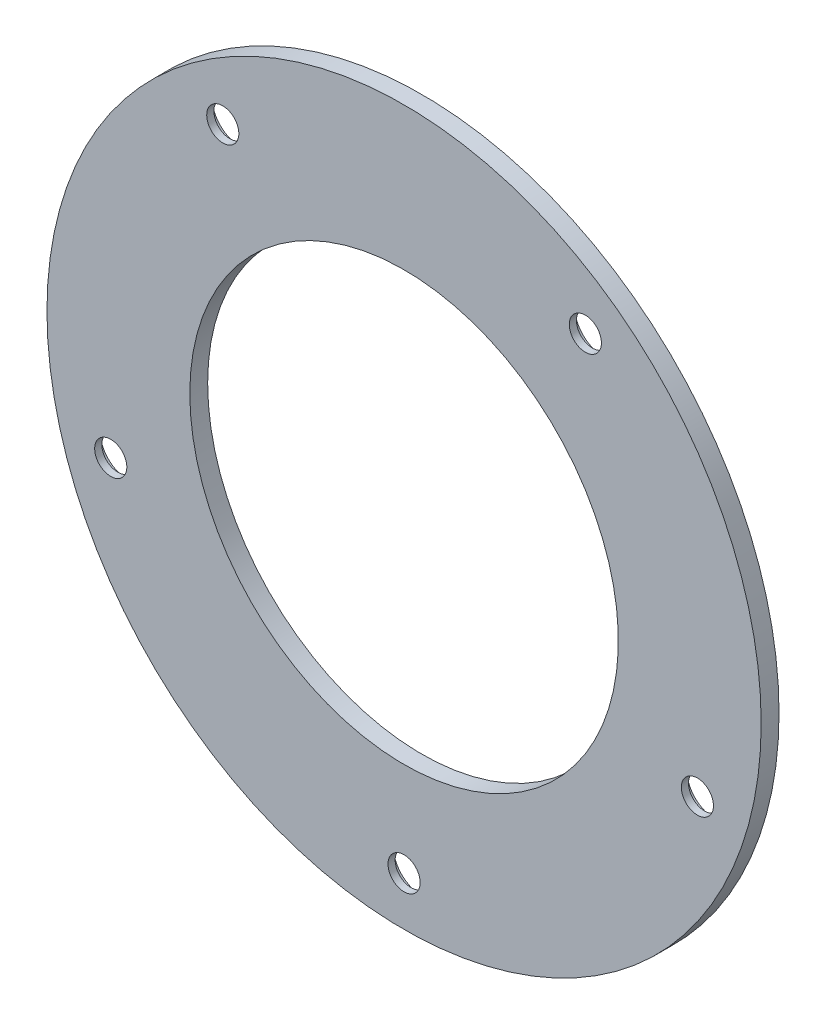
ISO-10303-21;
HEADER;
FILE_DESCRIPTION(('STEP AP214'),'2;1');
FILE_NAME('part.step','',(''),(''),'','','');
FILE_SCHEMA(('AUTOMOTIVE_DESIGN { 1 0 10303 214 1 1 1 1 }'));
ENDSEC;
DATA;
#1=APPLICATION_CONTEXT('core data for automotive mechanical design processes');
#2=APPLICATION_PROTOCOL_DEFINITION('international standard','automotive_design',2000,#1);
#3=PRODUCT_CONTEXT('',#1,'mechanical');
#4=PRODUCT('Part','Part','',(#3));
#5=PRODUCT_RELATED_PRODUCT_CATEGORY('part','',(#4));
#6=PRODUCT_DEFINITION_FORMATION('','',#4);
#7=PRODUCT_DEFINITION_CONTEXT('part definition',#1,'design');
#8=PRODUCT_DEFINITION('design','',#6,#7);
#9=PRODUCT_DEFINITION_SHAPE('','',#8);
#10=(LENGTH_UNIT() NAMED_UNIT(*) SI_UNIT(.MILLI.,.METRE.));
#11=(NAMED_UNIT(*) PLANE_ANGLE_UNIT() SI_UNIT($,.RADIAN.));
#12=(NAMED_UNIT(*) SI_UNIT($,.STERADIAN.) SOLID_ANGLE_UNIT());
#13=UNCERTAINTY_MEASURE_WITH_UNIT(LENGTH_MEASURE(1.E-05),#10,'distance_accuracy_value','');
#14=(GEOMETRIC_REPRESENTATION_CONTEXT(3) GLOBAL_UNCERTAINTY_ASSIGNED_CONTEXT((#13)) GLOBAL_UNIT_ASSIGNED_CONTEXT((#10,
#11,#12)) REPRESENTATION_CONTEXT('',''));
#15=CARTESIAN_POINT('',(0.,0.,0.));
#16=DIRECTION('',(0.,0.,1.));
#17=DIRECTION('',(1.,0.,0.));
#18=AXIS2_PLACEMENT_3D('',#15,#16,#17);
#19=CARTESIAN_POINT('',(0.,0.,22.5));
#20=DIRECTION('',(0.,0.,-1.));
#21=DIRECTION('',(0.,-1.,0.));
#22=AXIS2_PLACEMENT_3D('',#19,#20,#21);
#23=PLANE('',#22);
#24=CARTESIAN_POINT('',(0.,-43.1823986086603,22.5));
#25=DIRECTION('',(0.,0.,-1.));
#26=DIRECTION('',(-1.,0.,0.));
#27=AXIS2_PLACEMENT_3D('',#24,#25,#26);
#28=CIRCLE('',#27,4.);
#29=CARTESIAN_POINT('',(-4.,-43.1823986086603,22.5));
#30=VERTEX_POINT('',#29);
#31=EDGE_CURVE('E11',#30,#30,#28,.T.);
#32=ORIENTED_EDGE('',*,*,#31,.T.);
#33=EDGE_LOOP('',(#32));
#34=FACE_BOUND('',#33,.T.);
#35=CARTESIAN_POINT('',(0.,-43.1823986086603,22.5));
#36=DIRECTION('',(0.,0.,-1.));
#37=DIRECTION('',(-1.,0.,0.));
#38=AXIS2_PLACEMENT_3D('',#35,#36,#37);
#39=CIRCLE('',#38,2.25);
#40=CARTESIAN_POINT('',(-2.25,-43.1823986086603,22.5));
#41=VERTEX_POINT('',#40);
#42=EDGE_CURVE('E148',#41,#41,#39,.T.);
#43=ORIENTED_EDGE('',*,*,#42,.F.);
#44=EDGE_LOOP('',(#43));
#45=FACE_BOUND('',#44,.T.);
#46=ADVANCED_FACE('F17',(#34,#45),#23,.T.);
#47=CARTESIAN_POINT('',(0.,-43.1823986086603,22.5));
#48=DIRECTION('',(0.,0.,-1.));
#49=DIRECTION('',(-1.,0.,0.));
#50=AXIS2_PLACEMENT_3D('',#47,#48,#49);
#51=CYLINDRICAL_SURFACE('',#50,4.);
#52=CARTESIAN_POINT('',(0.,-43.1823986086603,21.));
#53=DIRECTION('',(0.,0.,-1.));
#54=DIRECTION('',(-1.,0.,0.));
#55=AXIS2_PLACEMENT_3D('',#52,#53,#54);
#56=CIRCLE('',#55,4.);
#57=CARTESIAN_POINT('',(-4.,-43.1823986086603,21.));
#58=VERTEX_POINT('',#57);
#59=EDGE_CURVE('E168',#58,#58,#56,.T.);
#60=ORIENTED_EDGE('',*,*,#59,.T.);
#61=EDGE_LOOP('',(#60));
#62=FACE_BOUND('',#61,.T.);
#63=ORIENTED_EDGE('',*,*,#31,.F.);
#64=EDGE_LOOP('',(#63));
#65=FACE_BOUND('',#64,.T.);
#66=ADVANCED_FACE('F205',(#62,#65),#51,.F.);
#67=CARTESIAN_POINT('',(0.,0.,22.5));
#68=DIRECTION('',(0.,0.,-1.));
#69=DIRECTION('',(0.,-1.,0.));
#70=AXIS2_PLACEMENT_3D('',#67,#68,#69);
#71=PLANE('',#70);
#72=CARTESIAN_POINT('',(-41.0689015860211,-13.3440950279491,22.5));
#73=DIRECTION('',(0.,0.,-1.));
#74=DIRECTION('',(-1.,0.,0.));
#75=AXIS2_PLACEMENT_3D('',#72,#73,#74);
#76=CIRCLE('',#75,4.);
#77=CARTESIAN_POINT('',(-45.0689015860211,-13.3440950279491,22.5));
#78=VERTEX_POINT('',#77);
#79=EDGE_CURVE('E28',#78,#78,#76,.T.);
#80=ORIENTED_EDGE('',*,*,#79,.T.);
#81=EDGE_LOOP('',(#80));
#82=FACE_BOUND('',#81,.T.);
#83=CARTESIAN_POINT('',(-41.0689015860211,-13.3440950279491,22.5));
#84=DIRECTION('',(0.,0.,-1.));
#85=DIRECTION('',(-1.,0.,0.));
#86=AXIS2_PLACEMENT_3D('',#83,#84,#85);
#87=CIRCLE('',#86,2.25);
#88=CARTESIAN_POINT('',(-43.3189015860211,-13.3440950279491,22.5));
#89=VERTEX_POINT('',#88);
#90=EDGE_CURVE('E140',#89,#89,#87,.T.);
#91=ORIENTED_EDGE('',*,*,#90,.F.);
#92=EDGE_LOOP('',(#91));
#93=FACE_BOUND('',#92,.T.);
#94=ADVANCED_FACE('F210',(#82,#93),#71,.T.);
#95=CARTESIAN_POINT('',(-41.0689015860211,-13.3440950279491,22.5));
#96=DIRECTION('',(0.,0.,-1.));
#97=DIRECTION('',(-1.,0.,0.));
#98=AXIS2_PLACEMENT_3D('',#95,#96,#97);
#99=CYLINDRICAL_SURFACE('',#98,4.);
#100=CARTESIAN_POINT('',(-41.0689015860211,-13.3440950279491,21.));
#101=DIRECTION('',(0.,0.,-1.));
#102=DIRECTION('',(-1.,0.,0.));
#103=AXIS2_PLACEMENT_3D('',#100,#101,#102);
#104=CIRCLE('',#103,4.);
#105=CARTESIAN_POINT('',(-45.0689015860211,-13.3440950279491,21.));
#106=VERTEX_POINT('',#105);
#107=EDGE_CURVE('E163',#106,#106,#104,.T.);
#108=ORIENTED_EDGE('',*,*,#107,.T.);
#109=EDGE_LOOP('',(#108));
#110=FACE_BOUND('',#109,.T.);
#111=ORIENTED_EDGE('',*,*,#79,.F.);
#112=EDGE_LOOP('',(#111));
#113=FACE_BOUND('',#112,.T.);
#114=ADVANCED_FACE('F259',(#110,#113),#99,.F.);
#115=CARTESIAN_POINT('',(0.,0.,22.5));
#116=DIRECTION('',(0.,0.,-1.));
#117=DIRECTION('',(0.,-1.,0.));
#118=AXIS2_PLACEMENT_3D('',#115,#116,#117);
#119=PLANE('',#118);
#120=CARTESIAN_POINT('',(41.0689015860212,-13.3440950279491,22.5));
#121=DIRECTION('',(0.,0.,-1.));
#122=DIRECTION('',(-1.,0.,0.));
#123=AXIS2_PLACEMENT_3D('',#120,#121,#122);
#124=CIRCLE('',#123,4.);
#125=CARTESIAN_POINT('',(37.0689015860212,-13.3440950279491,22.5));
#126=VERTEX_POINT('',#125);
#127=EDGE_CURVE('E98',#126,#126,#124,.T.);
#128=ORIENTED_EDGE('',*,*,#127,.T.);
#129=EDGE_LOOP('',(#128));
#130=FACE_BOUND('',#129,.T.);
#131=CARTESIAN_POINT('',(41.0689015860212,-13.3440950279491,22.5));
#132=DIRECTION('',(0.,0.,-1.));
#133=DIRECTION('',(-1.,0.,0.));
#134=AXIS2_PLACEMENT_3D('',#131,#132,#133);
#135=CIRCLE('',#134,2.25);
#136=CARTESIAN_POINT('',(38.8189015860212,-13.3440950279491,22.5));
#137=VERTEX_POINT('',#136);
#138=EDGE_CURVE('E159',#137,#137,#135,.T.);
#139=ORIENTED_EDGE('',*,*,#138,.F.);
#140=EDGE_LOOP('',(#139));
#141=FACE_BOUND('',#140,.T.);
#142=ADVANCED_FACE('F253',(#130,#141),#119,.T.);
#143=CARTESIAN_POINT('',(41.0689015860212,-13.3440950279491,22.5));
#144=DIRECTION('',(0.,0.,-1.));
#145=DIRECTION('',(-1.,0.,0.));
#146=AXIS2_PLACEMENT_3D('',#143,#144,#145);
#147=CYLINDRICAL_SURFACE('',#146,4.);
#148=CARTESIAN_POINT('',(41.0689015860212,-13.3440950279491,21.));
#149=DIRECTION('',(0.,0.,-1.));
#150=DIRECTION('',(-1.,0.,0.));
#151=AXIS2_PLACEMENT_3D('',#148,#149,#150);
#152=CIRCLE('',#151,4.);
#153=CARTESIAN_POINT('',(37.0689015860212,-13.3440950279491,21.));
#154=VERTEX_POINT('',#153);
#155=EDGE_CURVE('E167',#154,#154,#152,.T.);
#156=ORIENTED_EDGE('',*,*,#155,.T.);
#157=EDGE_LOOP('',(#156));
#158=FACE_BOUND('',#157,.T.);
#159=ORIENTED_EDGE('',*,*,#127,.F.);
#160=EDGE_LOOP('',(#159));
#161=FACE_BOUND('',#160,.T.);
#162=ADVANCED_FACE('F258',(#158,#161),#147,.F.);
#163=CARTESIAN_POINT('',(0.,0.,22.5));
#164=DIRECTION('',(0.,0.,-1.));
#165=DIRECTION('',(0.,-1.,0.));
#166=AXIS2_PLACEMENT_3D('',#163,#164,#165);
#167=PLANE('',#166);
#168=CARTESIAN_POINT('',(25.3819770607856,34.9352943322793,22.5));
#169=DIRECTION('',(0.,0.,-1.));
#170=DIRECTION('',(-1.,0.,0.));
#171=AXIS2_PLACEMENT_3D('',#168,#169,#170);
#172=CIRCLE('',#171,4.);
#173=CARTESIAN_POINT('',(21.3819770607856,34.9352943322793,22.5));
#174=VERTEX_POINT('',#173);
#175=EDGE_CURVE('E90',#174,#174,#172,.T.);
#176=ORIENTED_EDGE('',*,*,#175,.T.);
#177=EDGE_LOOP('',(#176));
#178=FACE_BOUND('',#177,.T.);
#179=CARTESIAN_POINT('',(25.3819770607856,34.9352943322793,22.5));
#180=DIRECTION('',(0.,0.,-1.));
#181=DIRECTION('',(-1.,0.,0.));
#182=AXIS2_PLACEMENT_3D('',#179,#180,#181);
#183=CIRCLE('',#182,2.25);
#184=CARTESIAN_POINT('',(23.1319770607856,34.9352943322793,22.5));
#185=VERTEX_POINT('',#184);
#186=EDGE_CURVE('E21',#185,#185,#183,.T.);
#187=ORIENTED_EDGE('',*,*,#186,.F.);
#188=EDGE_LOOP('',(#187));
#189=FACE_BOUND('',#188,.T.);
#190=ADVANCED_FACE('F338',(#178,#189),#167,.T.);
#191=CARTESIAN_POINT('',(25.3819770607856,34.9352943322793,22.5));
#192=DIRECTION('',(0.,0.,-1.));
#193=DIRECTION('',(-1.,0.,0.));
#194=AXIS2_PLACEMENT_3D('',#191,#192,#193);
#195=CYLINDRICAL_SURFACE('',#194,4.);
#196=CARTESIAN_POINT('',(25.3819770607856,34.9352943322793,21.));
#197=DIRECTION('',(0.,0.,-1.));
#198=DIRECTION('',(-1.,0.,0.));
#199=AXIS2_PLACEMENT_3D('',#196,#197,#198);
#200=CIRCLE('',#199,4.);
#201=CARTESIAN_POINT('',(21.3819770607856,34.9352943322793,21.));
#202=VERTEX_POINT('',#201);
#203=EDGE_CURVE('E185',#202,#202,#200,.T.);
#204=ORIENTED_EDGE('',*,*,#203,.T.);
#205=EDGE_LOOP('',(#204));
#206=FACE_BOUND('',#205,.T.);
#207=ORIENTED_EDGE('',*,*,#175,.F.);
#208=EDGE_LOOP('',(#207));
#209=FACE_BOUND('',#208,.T.);
#210=ADVANCED_FACE('F271',(#206,#209),#195,.F.);
#211=CARTESIAN_POINT('',(0.,0.,22.5));
#212=DIRECTION('',(0.,0.,-1.));
#213=DIRECTION('',(0.,-1.,0.));
#214=AXIS2_PLACEMENT_3D('',#211,#212,#213);
#215=PLANE('',#214);
#216=CARTESIAN_POINT('',(-25.3819770607856,34.9352943322793,22.5));
#217=DIRECTION('',(0.,0.,-1.));
#218=DIRECTION('',(-1.,0.,0.));
#219=AXIS2_PLACEMENT_3D('',#216,#217,#218);
#220=CIRCLE('',#219,4.);
#221=CARTESIAN_POINT('',(-29.3819770607856,34.9352943322793,22.5));
#222=VERTEX_POINT('',#221);
#223=EDGE_CURVE('E169',#222,#222,#220,.T.);
#224=ORIENTED_EDGE('',*,*,#223,.T.);
#225=EDGE_LOOP('',(#224));
#226=FACE_BOUND('',#225,.T.);
#227=CARTESIAN_POINT('',(-25.3819770607856,34.9352943322793,22.5));
#228=DIRECTION('',(0.,0.,-1.));
#229=DIRECTION('',(-1.,0.,0.));
#230=AXIS2_PLACEMENT_3D('',#227,#228,#229);
#231=CIRCLE('',#230,2.25);
#232=CARTESIAN_POINT('',(-27.6319770607855,34.9352943322793,22.5));
#233=VERTEX_POINT('',#232);
#234=EDGE_CURVE('E175',#233,#233,#231,.T.);
#235=ORIENTED_EDGE('',*,*,#234,.F.);
#236=EDGE_LOOP('',(#235));
#237=FACE_BOUND('',#236,.T.);
#238=ADVANCED_FACE('F265',(#226,#237),#215,.T.);
#239=CARTESIAN_POINT('',(-25.3819770607856,34.9352943322793,22.5));
#240=DIRECTION('',(0.,0.,-1.));
#241=DIRECTION('',(-1.,0.,0.));
#242=AXIS2_PLACEMENT_3D('',#239,#240,#241);
#243=CYLINDRICAL_SURFACE('',#242,4.);
#244=CARTESIAN_POINT('',(-25.3819770607856,34.9352943322793,21.));
#245=DIRECTION('',(0.,0.,-1.));
#246=DIRECTION('',(-1.,0.,0.));
#247=AXIS2_PLACEMENT_3D('',#244,#245,#246);
#248=CIRCLE('',#247,4.);
#249=CARTESIAN_POINT('',(-29.3819770607856,34.9352943322793,21.));
#250=VERTEX_POINT('',#249);
#251=EDGE_CURVE('E172',#250,#250,#248,.T.);
#252=ORIENTED_EDGE('',*,*,#251,.T.);
#253=EDGE_LOOP('',(#252));
#254=FACE_BOUND('',#253,.T.);
#255=ORIENTED_EDGE('',*,*,#223,.F.);
#256=EDGE_LOOP('',(#255));
#257=FACE_BOUND('',#256,.T.);
#258=ADVANCED_FACE('F270',(#254,#257),#243,.F.);
#259=CARTESIAN_POINT('',(0.,0.,23.5));
#260=DIRECTION('',(0.,0.,-1.));
#261=DIRECTION('',(0.,-1.,0.));
#262=AXIS2_PLACEMENT_3D('',#259,#260,#261);
#263=PLANE('',#262);
#264=CARTESIAN_POINT('',(0.,0.,23.5));
#265=DIRECTION('',(0.,0.,1.));
#266=DIRECTION('',(1.,0.,0.));
#267=AXIS2_PLACEMENT_3D('',#264,#265,#266);
#268=CIRCLE('',#267,50.);
#269=CARTESIAN_POINT('',(50.,0.,23.5));
#270=VERTEX_POINT('',#269);
#271=EDGE_CURVE('E192',#270,#270,#268,.T.);
#272=ORIENTED_EDGE('',*,*,#271,.T.);
#273=EDGE_LOOP('',(#272));
#274=FACE_BOUND('',#273,.T.);
#275=CARTESIAN_POINT('',(41.0689015860212,-13.3440950279491,23.5));
#276=DIRECTION('',(0.,0.,-1.));
#277=DIRECTION('',(-1.,0.,0.));
#278=AXIS2_PLACEMENT_3D('',#275,#276,#277);
#279=CIRCLE('',#278,2.25);
#280=CARTESIAN_POINT('',(38.8189015860212,-13.3440950279491,23.5));
#281=VERTEX_POINT('',#280);
#282=EDGE_CURVE('E162',#281,#281,#279,.T.);
#283=ORIENTED_EDGE('',*,*,#282,.T.);
#284=EDGE_LOOP('',(#283));
#285=FACE_BOUND('',#284,.T.);
#286=CARTESIAN_POINT('',(25.3819770607856,34.9352943322793,23.5));
#287=DIRECTION('',(0.,0.,-1.));
#288=DIRECTION('',(-1.,0.,0.));
#289=AXIS2_PLACEMENT_3D('',#286,#287,#288);
#290=CIRCLE('',#289,2.25);
#291=CARTESIAN_POINT('',(23.1319770607856,34.9352943322793,23.5));
#292=VERTEX_POINT('',#291);
#293=EDGE_CURVE('E161',#292,#292,#290,.T.);
#294=ORIENTED_EDGE('',*,*,#293,.T.);
#295=EDGE_LOOP('',(#294));
#296=FACE_BOUND('',#295,.T.);
#297=CARTESIAN_POINT('',(-25.3819770607856,34.9352943322793,23.5));
#298=DIRECTION('',(0.,0.,-1.));
#299=DIRECTION('',(-1.,0.,0.));
#300=AXIS2_PLACEMENT_3D('',#297,#298,#299);
#301=CIRCLE('',#300,2.25);
#302=CARTESIAN_POINT('',(-27.6319770607855,34.9352943322793,23.5));
#303=VERTEX_POINT('',#302);
#304=EDGE_CURVE('E178',#303,#303,#301,.T.);
#305=ORIENTED_EDGE('',*,*,#304,.T.);
#306=EDGE_LOOP('',(#305));
#307=FACE_BOUND('',#306,.T.);
#308=CARTESIAN_POINT('',(-41.0689015860211,-13.3440950279491,23.5));
#309=DIRECTION('',(0.,0.,-1.));
#310=DIRECTION('',(-1.,0.,0.));
#311=AXIS2_PLACEMENT_3D('',#308,#309,#310);
#312=CIRCLE('',#311,2.25);
#313=CARTESIAN_POINT('',(-43.3189015860211,-13.3440950279491,23.5));
#314=VERTEX_POINT('',#313);
#315=EDGE_CURVE('E155',#314,#314,#312,.T.);
#316=ORIENTED_EDGE('',*,*,#315,.T.);
#317=EDGE_LOOP('',(#316));
#318=FACE_BOUND('',#317,.T.);
#319=CARTESIAN_POINT('',(0.,-43.1823986086603,23.5));
#320=DIRECTION('',(0.,0.,-1.));
#321=DIRECTION('',(-1.,0.,0.));
#322=AXIS2_PLACEMENT_3D('',#319,#320,#321);
#323=CIRCLE('',#322,2.25);
#324=CARTESIAN_POINT('',(-2.25,-43.1823986086603,23.5));
#325=VERTEX_POINT('',#324);
#326=EDGE_CURVE('E145',#325,#325,#323,.T.);
#327=ORIENTED_EDGE('',*,*,#326,.T.);
#328=EDGE_LOOP('',(#327));
#329=FACE_BOUND('',#328,.T.);
#330=CARTESIAN_POINT('',(0.,0.,23.5));
#331=DIRECTION('',(0.,0.,-1.));
#332=DIRECTION('',(-1.,0.,0.));
#333=AXIS2_PLACEMENT_3D('',#330,#331,#332);
#334=CIRCLE('',#333,30.);
#335=CARTESIAN_POINT('',(-30.,0.,23.5));
#336=VERTEX_POINT('',#335);
#337=EDGE_CURVE('E119',#336,#336,#334,.T.);
#338=ORIENTED_EDGE('',*,*,#337,.T.);
#339=EDGE_LOOP('',(#338));
#340=FACE_BOUND('',#339,.T.);
#341=ADVANCED_FACE('F19',(#274,#285,#296,#307,#318,#329,#340),#263,.F.);
#342=CARTESIAN_POINT('',(0.,0.,21.));
#343=DIRECTION('',(0.,0.,-1.));
#344=DIRECTION('',(0.,-1.,0.));
#345=AXIS2_PLACEMENT_3D('',#342,#343,#344);
#346=PLANE('',#345);
#347=CARTESIAN_POINT('',(0.,0.,21.));
#348=DIRECTION('',(0.,0.,1.));
#349=DIRECTION('',(1.,0.,0.));
#350=AXIS2_PLACEMENT_3D('',#347,#348,#349);
#351=CIRCLE('',#350,50.);
#352=CARTESIAN_POINT('',(50.,0.,21.));
#353=VERTEX_POINT('',#352);
#354=EDGE_CURVE('E195',#353,#353,#351,.T.);
#355=ORIENTED_EDGE('',*,*,#354,.F.);
#356=EDGE_LOOP('',(#355));
#357=FACE_BOUND('',#356,.T.);
#358=CARTESIAN_POINT('',(0.,0.,21.));
#359=DIRECTION('',(0.,0.,-1.));
#360=DIRECTION('',(-1.,0.,0.));
#361=AXIS2_PLACEMENT_3D('',#358,#359,#360);
#362=CIRCLE('',#361,30.);
#363=CARTESIAN_POINT('',(-30.,0.,21.));
#364=VERTEX_POINT('',#363);
#365=EDGE_CURVE('E110',#364,#364,#362,.T.);
#366=ORIENTED_EDGE('',*,*,#365,.F.);
#367=EDGE_LOOP('',(#366));
#368=FACE_BOUND('',#367,.T.);
#369=ORIENTED_EDGE('',*,*,#251,.F.);
#370=EDGE_LOOP('',(#369));
#371=FACE_BOUND('',#370,.T.);
#372=ORIENTED_EDGE('',*,*,#203,.F.);
#373=EDGE_LOOP('',(#372));
#374=FACE_BOUND('',#373,.T.);
#375=ORIENTED_EDGE('',*,*,#155,.F.);
#376=EDGE_LOOP('',(#375));
#377=FACE_BOUND('',#376,.T.);
#378=ORIENTED_EDGE('',*,*,#107,.F.);
#379=EDGE_LOOP('',(#378));
#380=FACE_BOUND('',#379,.T.);
#381=ORIENTED_EDGE('',*,*,#59,.F.);
#382=EDGE_LOOP('',(#381));
#383=FACE_BOUND('',#382,.T.);
#384=ADVANCED_FACE('F278',(#357,#368,#371,#374,#377,#380,#383),#346,.T.);
#385=CARTESIAN_POINT('',(0.,0.,21.));
#386=DIRECTION('',(0.,0.,1.));
#387=DIRECTION('',(1.,0.,0.));
#388=AXIS2_PLACEMENT_3D('',#385,#386,#387);
#389=CYLINDRICAL_SURFACE('',#388,50.);
#390=ORIENTED_EDGE('',*,*,#271,.F.);
#391=EDGE_LOOP('',(#390));
#392=FACE_BOUND('',#391,.T.);
#393=ORIENTED_EDGE('',*,*,#354,.T.);
#394=EDGE_LOOP('',(#393));
#395=FACE_BOUND('',#394,.T.);
#396=ADVANCED_FACE('F247',(#392,#395),#389,.T.);
#397=CARTESIAN_POINT('',(0.,0.,21.));
#398=DIRECTION('',(0.,0.,1.));
#399=DIRECTION('',(1.,0.,0.));
#400=AXIS2_PLACEMENT_3D('',#397,#398,#399);
#401=CYLINDRICAL_SURFACE('',#400,30.);
#402=ORIENTED_EDGE('',*,*,#337,.F.);
#403=EDGE_LOOP('',(#402));
#404=FACE_BOUND('',#403,.T.);
#405=ORIENTED_EDGE('',*,*,#365,.T.);
#406=EDGE_LOOP('',(#405));
#407=FACE_BOUND('',#406,.T.);
#408=ADVANCED_FACE('F224',(#404,#407),#401,.F.);
#409=CARTESIAN_POINT('',(0.,-43.1823986086603,21.));
#410=DIRECTION('',(0.,0.,1.));
#411=DIRECTION('',(1.,0.,0.));
#412=AXIS2_PLACEMENT_3D('',#409,#410,#411);
#413=CYLINDRICAL_SURFACE('',#412,2.25);
#414=ORIENTED_EDGE('',*,*,#42,.T.);
#415=EDGE_LOOP('',(#414));
#416=FACE_BOUND('',#415,.T.);
#417=ORIENTED_EDGE('',*,*,#326,.F.);
#418=EDGE_LOOP('',(#417));
#419=FACE_BOUND('',#418,.T.);
#420=ADVANCED_FACE('F218',(#416,#419),#413,.F.);
#421=CARTESIAN_POINT('',(-41.0689015860211,-13.3440950279491,21.));
#422=DIRECTION('',(0.,0.,1.));
#423=DIRECTION('',(1.,0.,0.));
#424=AXIS2_PLACEMENT_3D('',#421,#422,#423);
#425=CYLINDRICAL_SURFACE('',#424,2.25);
#426=ORIENTED_EDGE('',*,*,#90,.T.);
#427=EDGE_LOOP('',(#426));
#428=FACE_BOUND('',#427,.T.);
#429=ORIENTED_EDGE('',*,*,#315,.F.);
#430=EDGE_LOOP('',(#429));
#431=FACE_BOUND('',#430,.T.);
#432=ADVANCED_FACE('F223',(#428,#431),#425,.F.);
#433=CARTESIAN_POINT('',(-25.3819770607856,34.9352943322793,21.));
#434=DIRECTION('',(0.,0.,1.));
#435=DIRECTION('',(1.,0.,0.));
#436=AXIS2_PLACEMENT_3D('',#433,#434,#435);
#437=CYLINDRICAL_SURFACE('',#436,2.25);
#438=ORIENTED_EDGE('',*,*,#234,.T.);
#439=EDGE_LOOP('',(#438));
#440=FACE_BOUND('',#439,.T.);
#441=ORIENTED_EDGE('',*,*,#304,.F.);
#442=EDGE_LOOP('',(#441));
#443=FACE_BOUND('',#442,.T.);
#444=ADVANCED_FACE('F237',(#440,#443),#437,.F.);
#445=CARTESIAN_POINT('',(25.3819770607856,34.9352943322793,21.));
#446=DIRECTION('',(0.,0.,1.));
#447=DIRECTION('',(1.,0.,0.));
#448=AXIS2_PLACEMENT_3D('',#445,#446,#447);
#449=CYLINDRICAL_SURFACE('',#448,2.25);
#450=ORIENTED_EDGE('',*,*,#186,.T.);
#451=EDGE_LOOP('',(#450));
#452=FACE_BOUND('',#451,.T.);
#453=ORIENTED_EDGE('',*,*,#293,.F.);
#454=EDGE_LOOP('',(#453));
#455=FACE_BOUND('',#454,.T.);
#456=ADVANCED_FACE('F231',(#452,#455),#449,.F.);
#457=CARTESIAN_POINT('',(41.0689015860212,-13.3440950279491,21.));
#458=DIRECTION('',(0.,0.,1.));
#459=DIRECTION('',(1.,0.,0.));
#460=AXIS2_PLACEMENT_3D('',#457,#458,#459);
#461=CYLINDRICAL_SURFACE('',#460,2.25);
#462=ORIENTED_EDGE('',*,*,#138,.T.);
#463=EDGE_LOOP('',(#462));
#464=FACE_BOUND('',#463,.T.);
#465=ORIENTED_EDGE('',*,*,#282,.F.);
#466=EDGE_LOOP('',(#465));
#467=FACE_BOUND('',#466,.T.);
#468=ADVANCED_FACE('F236',(#464,#467),#461,.F.);
#469=CLOSED_SHELL('',(#46,#66,#94,#114,#142,#162,#190,#210,#238,#258,#341,#384,#396,#408,#420,
#432,#444,#456,#468));
#470=MANIFOLD_SOLID_BREP('B1',#469);
#471=ADVANCED_BREP_SHAPE_REPRESENTATION('',(#18,#470),#14);
#472=SHAPE_DEFINITION_REPRESENTATION(#9,#471);
ENDSEC;
END-ISO-10303-21;
